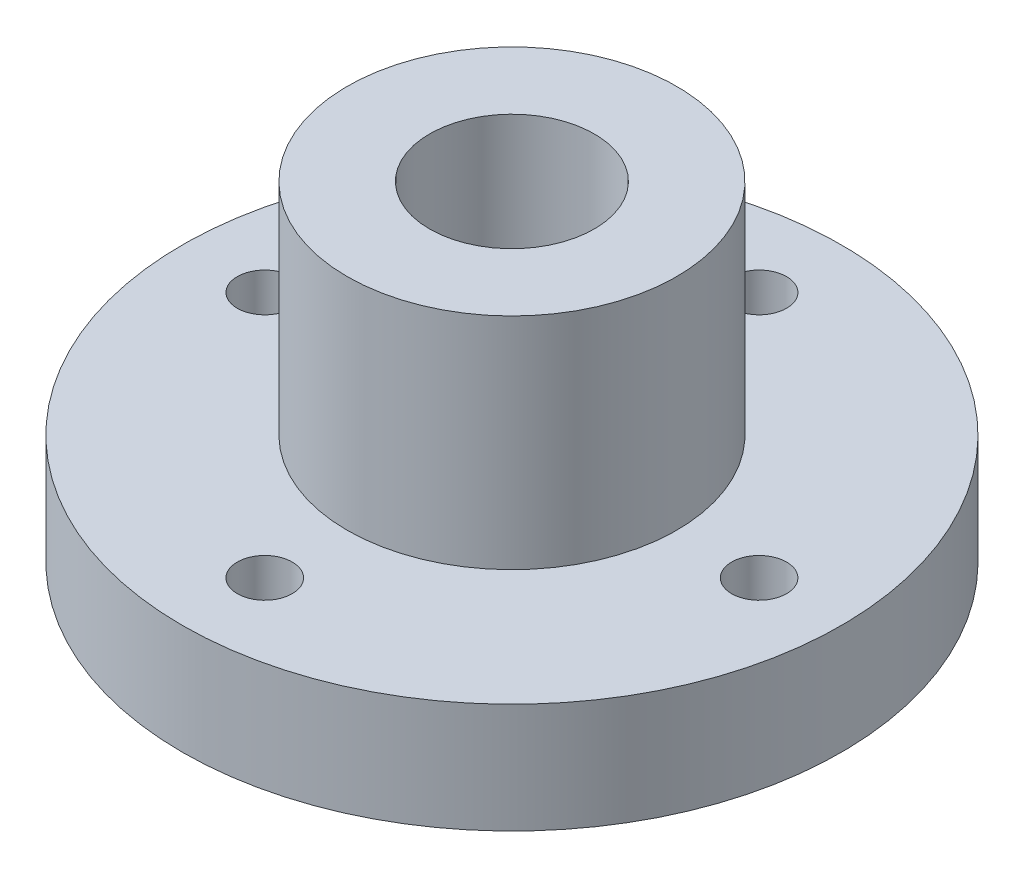
ISO-10303-21;
HEADER;
FILE_DESCRIPTION(('STEP AP214'),'2;1');
FILE_NAME('part.step','',(''),(''),'','','');
FILE_SCHEMA(('AUTOMOTIVE_DESIGN { 1 0 10303 214 1 1 1 1 }'));
ENDSEC;
DATA;
#1=APPLICATION_CONTEXT('core data for automotive mechanical design processes');
#2=APPLICATION_PROTOCOL_DEFINITION('international standard','automotive_design',2000,#1);
#3=PRODUCT_CONTEXT('',#1,'mechanical');
#4=PRODUCT('Part','Part','',(#3));
#5=PRODUCT_RELATED_PRODUCT_CATEGORY('part','',(#4));
#6=PRODUCT_DEFINITION_FORMATION('','',#4);
#7=PRODUCT_DEFINITION_CONTEXT('part definition',#1,'design');
#8=PRODUCT_DEFINITION('design','',#6,#7);
#9=PRODUCT_DEFINITION_SHAPE('','',#8);
#10=(LENGTH_UNIT() NAMED_UNIT(*) SI_UNIT(.MILLI.,.METRE.));
#11=(NAMED_UNIT(*) PLANE_ANGLE_UNIT() SI_UNIT($,.RADIAN.));
#12=(NAMED_UNIT(*) SI_UNIT($,.STERADIAN.) SOLID_ANGLE_UNIT());
#13=UNCERTAINTY_MEASURE_WITH_UNIT(LENGTH_MEASURE(1.E-05),#10,'distance_accuracy_value','');
#14=(GEOMETRIC_REPRESENTATION_CONTEXT(3) GLOBAL_UNCERTAINTY_ASSIGNED_CONTEXT((#13)) GLOBAL_UNIT_ASSIGNED_CONTEXT((#10,
#11,#12)) REPRESENTATION_CONTEXT('',''));
#15=CARTESIAN_POINT('',(0.,0.,0.));
#16=DIRECTION('',(0.,0.,1.));
#17=DIRECTION('',(1.,0.,0.));
#18=AXIS2_PLACEMENT_3D('',#15,#16,#17);
#19=CARTESIAN_POINT('',(0.,1.,-2.25));
#20=DIRECTION('',(0.,-1.,0.));
#21=DIRECTION('',(0.,0.,-1.));
#22=AXIS2_PLACEMENT_3D('',#19,#20,#21);
#23=CYLINDRICAL_SURFACE('',#22,0.25);
#24=CARTESIAN_POINT('',(0.,1.,-2.25));
#25=DIRECTION('',(0.,1.,0.));
#26=DIRECTION('',(0.,0.,1.));
#27=AXIS2_PLACEMENT_3D('',#24,#25,#26);
#28=CIRCLE('',#27,0.25);
#29=CARTESIAN_POINT('',(0.,1.,-2.));
#30=VERTEX_POINT('',#29);
#31=EDGE_CURVE('E52',#30,#30,#28,.T.);
#32=ORIENTED_EDGE('',*,*,#31,.T.);
#33=EDGE_LOOP('',(#32));
#34=FACE_BOUND('',#33,.T.);
#35=CARTESIAN_POINT('',(0.,0.,-2.25));
#36=DIRECTION('',(0.,1.,0.));
#37=DIRECTION('',(0.,0.,1.));
#38=AXIS2_PLACEMENT_3D('',#35,#36,#37);
#39=CIRCLE('',#38,0.25);
#40=CARTESIAN_POINT('',(0.,0.,-2.));
#41=VERTEX_POINT('',#40);
#42=EDGE_CURVE('E68',#41,#41,#39,.T.);
#43=ORIENTED_EDGE('',*,*,#42,.F.);
#44=EDGE_LOOP('',(#43));
#45=FACE_BOUND('',#44,.T.);
#46=ADVANCED_FACE('F37',(#34,#45),#23,.F.);
#47=CARTESIAN_POINT('',(2.25,1.,0.));
#48=DIRECTION('',(0.,-1.,0.));
#49=DIRECTION('',(0.,0.,-1.));
#50=AXIS2_PLACEMENT_3D('',#47,#48,#49);
#51=CYLINDRICAL_SURFACE('',#50,0.250000000000007);
#52=CARTESIAN_POINT('',(2.25,1.,0.));
#53=DIRECTION('',(0.,1.,0.));
#54=DIRECTION('',(0.,0.,1.));
#55=AXIS2_PLACEMENT_3D('',#52,#53,#54);
#56=CIRCLE('',#55,0.250000000000007);
#57=CARTESIAN_POINT('',(2.25,1.,0.250000000000008));
#58=VERTEX_POINT('',#57);
#59=EDGE_CURVE('E86',#58,#58,#56,.T.);
#60=ORIENTED_EDGE('',*,*,#59,.T.);
#61=EDGE_LOOP('',(#60));
#62=FACE_BOUND('',#61,.T.);
#63=CARTESIAN_POINT('',(2.25,0.,0.));
#64=DIRECTION('',(0.,1.,0.));
#65=DIRECTION('',(0.,0.,1.));
#66=AXIS2_PLACEMENT_3D('',#63,#64,#65);
#67=CIRCLE('',#66,0.250000000000007);
#68=CARTESIAN_POINT('',(2.25,0.,0.250000000000008));
#69=VERTEX_POINT('',#68);
#70=EDGE_CURVE('E65',#69,#69,#67,.T.);
#71=ORIENTED_EDGE('',*,*,#70,.F.);
#72=EDGE_LOOP('',(#71));
#73=FACE_BOUND('',#72,.T.);
#74=ADVANCED_FACE('F138',(#62,#73),#51,.F.);
#75=CARTESIAN_POINT('',(0.,1.,2.25));
#76=DIRECTION('',(0.,-1.,0.));
#77=DIRECTION('',(0.,0.,-1.));
#78=AXIS2_PLACEMENT_3D('',#75,#76,#77);
#79=CYLINDRICAL_SURFACE('',#78,0.250000000000015);
#80=CARTESIAN_POINT('',(0.,1.,2.25));
#81=DIRECTION('',(0.,1.,0.));
#82=DIRECTION('',(0.,0.,1.));
#83=AXIS2_PLACEMENT_3D('',#80,#81,#82);
#84=CIRCLE('',#83,0.250000000000015);
#85=CARTESIAN_POINT('',(0.,1.,2.50000000000002));
#86=VERTEX_POINT('',#85);
#87=EDGE_CURVE('E80',#86,#86,#84,.T.);
#88=ORIENTED_EDGE('',*,*,#87,.T.);
#89=EDGE_LOOP('',(#88));
#90=FACE_BOUND('',#89,.T.);
#91=CARTESIAN_POINT('',(0.,0.,2.25));
#92=DIRECTION('',(0.,1.,0.));
#93=DIRECTION('',(0.,0.,1.));
#94=AXIS2_PLACEMENT_3D('',#91,#92,#93);
#95=CIRCLE('',#94,0.250000000000015);
#96=CARTESIAN_POINT('',(0.,0.,2.50000000000002));
#97=VERTEX_POINT('',#96);
#98=EDGE_CURVE('E60',#97,#97,#95,.T.);
#99=ORIENTED_EDGE('',*,*,#98,.F.);
#100=EDGE_LOOP('',(#99));
#101=FACE_BOUND('',#100,.T.);
#102=ADVANCED_FACE('F143',(#90,#101),#79,.F.);
#103=CARTESIAN_POINT('',(-2.25,1.,0.));
#104=DIRECTION('',(0.,-1.,0.));
#105=DIRECTION('',(0.,0.,-1.));
#106=AXIS2_PLACEMENT_3D('',#103,#104,#105);
#107=CYLINDRICAL_SURFACE('',#106,0.250000000000022);
#108=CARTESIAN_POINT('',(-2.25,1.,0.));
#109=DIRECTION('',(0.,1.,0.));
#110=DIRECTION('',(0.,0.,1.));
#111=AXIS2_PLACEMENT_3D('',#108,#109,#110);
#112=CIRCLE('',#111,0.250000000000022);
#113=CARTESIAN_POINT('',(-2.25,1.,0.250000000000022));
#114=VERTEX_POINT('',#113);
#115=EDGE_CURVE('E75',#114,#114,#112,.T.);
#116=ORIENTED_EDGE('',*,*,#115,.T.);
#117=EDGE_LOOP('',(#116));
#118=FACE_BOUND('',#117,.T.);
#119=CARTESIAN_POINT('',(-2.25,0.,0.));
#120=DIRECTION('',(0.,1.,0.));
#121=DIRECTION('',(0.,0.,1.));
#122=AXIS2_PLACEMENT_3D('',#119,#120,#121);
#123=CIRCLE('',#122,0.250000000000022);
#124=CARTESIAN_POINT('',(-2.25,0.,0.250000000000022));
#125=VERTEX_POINT('',#124);
#126=EDGE_CURVE('E56',#125,#125,#123,.T.);
#127=ORIENTED_EDGE('',*,*,#126,.F.);
#128=EDGE_LOOP('',(#127));
#129=FACE_BOUND('',#128,.T.);
#130=ADVANCED_FACE('F39',(#118,#129),#107,.F.);
#131=CARTESIAN_POINT('',(0.,1.,0.));
#132=DIRECTION('',(0.,-1.,0.));
#133=DIRECTION('',(0.,0.,-1.));
#134=AXIS2_PLACEMENT_3D('',#131,#132,#133);
#135=CYLINDRICAL_SURFACE('',#134,3.);
#136=CARTESIAN_POINT('',(0.,1.,0.));
#137=DIRECTION('',(0.,1.,0.));
#138=DIRECTION('',(0.,0.,1.));
#139=AXIS2_PLACEMENT_3D('',#136,#137,#138);
#140=CIRCLE('',#139,3.);
#141=CARTESIAN_POINT('',(0.,1.,3.));
#142=VERTEX_POINT('',#141);
#143=EDGE_CURVE('E10',#142,#142,#140,.T.);
#144=ORIENTED_EDGE('',*,*,#143,.F.);
#145=EDGE_LOOP('',(#144));
#146=FACE_BOUND('',#145,.T.);
#147=CARTESIAN_POINT('',(0.,0.,0.));
#148=DIRECTION('',(0.,1.,0.));
#149=DIRECTION('',(0.,0.,1.));
#150=AXIS2_PLACEMENT_3D('',#147,#148,#149);
#151=CIRCLE('',#150,3.);
#152=CARTESIAN_POINT('',(0.,0.,3.));
#153=VERTEX_POINT('',#152);
#154=EDGE_CURVE('E41',#153,#153,#151,.T.);
#155=ORIENTED_EDGE('',*,*,#154,.T.);
#156=EDGE_LOOP('',(#155));
#157=FACE_BOUND('',#156,.T.);
#158=ADVANCED_FACE('F104',(#146,#157),#135,.T.);
#159=CARTESIAN_POINT('',(0.,1.,0.));
#160=DIRECTION('',(0.,1.,0.));
#161=DIRECTION('',(0.,0.,1.));
#162=AXIS2_PLACEMENT_3D('',#159,#160,#161);
#163=PLANE('',#162);
#164=ORIENTED_EDGE('',*,*,#115,.F.);
#165=EDGE_LOOP('',(#164));
#166=FACE_BOUND('',#165,.T.);
#167=ORIENTED_EDGE('',*,*,#87,.F.);
#168=EDGE_LOOP('',(#167));
#169=FACE_BOUND('',#168,.T.);
#170=ORIENTED_EDGE('',*,*,#59,.F.);
#171=EDGE_LOOP('',(#170));
#172=FACE_BOUND('',#171,.T.);
#173=ORIENTED_EDGE('',*,*,#31,.F.);
#174=EDGE_LOOP('',(#173));
#175=FACE_BOUND('',#174,.T.);
#176=CARTESIAN_POINT('',(0.,1.,0.));
#177=DIRECTION('',(0.,1.,0.));
#178=DIRECTION('',(0.,0.,1.));
#179=AXIS2_PLACEMENT_3D('',#176,#177,#178);
#180=CIRCLE('',#179,1.5);
#181=CARTESIAN_POINT('',(0.,1.,1.5));
#182=VERTEX_POINT('',#181);
#183=EDGE_CURVE('E46',#182,#182,#180,.T.);
#184=ORIENTED_EDGE('',*,*,#183,.F.);
#185=EDGE_LOOP('',(#184));
#186=FACE_BOUND('',#185,.T.);
#187=ORIENTED_EDGE('',*,*,#143,.T.);
#188=EDGE_LOOP('',(#187));
#189=FACE_BOUND('',#188,.T.);
#190=ADVANCED_FACE('F100',(#166,#169,#172,#175,#186,#189),#163,.T.);
#191=CARTESIAN_POINT('',(0.,0.,0.));
#192=DIRECTION('',(0.,1.,0.));
#193=DIRECTION('',(0.,0.,1.));
#194=AXIS2_PLACEMENT_3D('',#191,#192,#193);
#195=PLANE('',#194);
#196=ORIENTED_EDGE('',*,*,#126,.T.);
#197=EDGE_LOOP('',(#196));
#198=FACE_BOUND('',#197,.T.);
#199=ORIENTED_EDGE('',*,*,#98,.T.);
#200=EDGE_LOOP('',(#199));
#201=FACE_BOUND('',#200,.T.);
#202=ORIENTED_EDGE('',*,*,#70,.T.);
#203=EDGE_LOOP('',(#202));
#204=FACE_BOUND('',#203,.T.);
#205=ORIENTED_EDGE('',*,*,#42,.T.);
#206=EDGE_LOOP('',(#205));
#207=FACE_BOUND('',#206,.T.);
#208=ORIENTED_EDGE('',*,*,#154,.F.);
#209=EDGE_LOOP('',(#208));
#210=FACE_BOUND('',#209,.T.);
#211=CARTESIAN_POINT('',(0.,0.,0.));
#212=DIRECTION('',(0.,1.,0.));
#213=DIRECTION('',(0.,0.,1.));
#214=AXIS2_PLACEMENT_3D('',#211,#212,#213);
#215=CIRCLE('',#214,0.75);
#216=CARTESIAN_POINT('',(0.,0.,0.75));
#217=VERTEX_POINT('',#216);
#218=EDGE_CURVE('E89',#217,#217,#215,.T.);
#219=ORIENTED_EDGE('',*,*,#218,.T.);
#220=EDGE_LOOP('',(#219));
#221=FACE_BOUND('',#220,.T.);
#222=ADVANCED_FACE('F103',(#198,#201,#204,#207,#210,#221),#195,.F.);
#223=CARTESIAN_POINT('',(0.,3.,0.));
#224=DIRECTION('',(0.,-1.,0.));
#225=DIRECTION('',(0.,0.,-1.));
#226=AXIS2_PLACEMENT_3D('',#223,#224,#225);
#227=CYLINDRICAL_SURFACE('',#226,0.75);
#228=CARTESIAN_POINT('',(0.,3.,0.));
#229=DIRECTION('',(0.,1.,0.));
#230=DIRECTION('',(0.,0.,1.));
#231=AXIS2_PLACEMENT_3D('',#228,#229,#230);
#232=CIRCLE('',#231,0.75);
#233=CARTESIAN_POINT('',(0.,3.,0.75));
#234=VERTEX_POINT('',#233);
#235=EDGE_CURVE('E119',#234,#234,#232,.T.);
#236=ORIENTED_EDGE('',*,*,#235,.T.);
#237=EDGE_LOOP('',(#236));
#238=FACE_BOUND('',#237,.T.);
#239=ORIENTED_EDGE('',*,*,#218,.F.);
#240=EDGE_LOOP('',(#239));
#241=FACE_BOUND('',#240,.T.);
#242=ADVANCED_FACE('F113',(#238,#241),#227,.F.);
#243=CARTESIAN_POINT('',(0.,3.,0.));
#244=DIRECTION('',(0.,-1.,0.));
#245=DIRECTION('',(0.,0.,-1.));
#246=AXIS2_PLACEMENT_3D('',#243,#244,#245);
#247=CYLINDRICAL_SURFACE('',#246,1.5);
#248=ORIENTED_EDGE('',*,*,#183,.T.);
#249=EDGE_LOOP('',(#248));
#250=FACE_BOUND('',#249,.T.);
#251=CARTESIAN_POINT('',(0.,3.,0.));
#252=DIRECTION('',(0.,1.,0.));
#253=DIRECTION('',(0.,0.,1.));
#254=AXIS2_PLACEMENT_3D('',#251,#252,#253);
#255=CIRCLE('',#254,1.5);
#256=CARTESIAN_POINT('',(0.,3.,1.5));
#257=VERTEX_POINT('',#256);
#258=EDGE_CURVE('E61',#257,#257,#255,.T.);
#259=ORIENTED_EDGE('',*,*,#258,.F.);
#260=EDGE_LOOP('',(#259));
#261=FACE_BOUND('',#260,.T.);
#262=ADVANCED_FACE('F109',(#250,#261),#247,.T.);
#263=CARTESIAN_POINT('',(0.,3.,0.));
#264=DIRECTION('',(0.,1.,0.));
#265=DIRECTION('',(0.,0.,1.));
#266=AXIS2_PLACEMENT_3D('',#263,#264,#265);
#267=PLANE('',#266);
#268=ORIENTED_EDGE('',*,*,#235,.F.);
#269=EDGE_LOOP('',(#268));
#270=FACE_BOUND('',#269,.T.);
#271=ORIENTED_EDGE('',*,*,#258,.T.);
#272=EDGE_LOOP('',(#271));
#273=FACE_BOUND('',#272,.T.);
#274=ADVANCED_FACE('F112',(#270,#273),#267,.T.);
#275=CLOSED_SHELL('',(#46,#74,#102,#130,#158,#190,#222,#242,#262,#274));
#276=MANIFOLD_SOLID_BREP('B2',#275);
#277=ADVANCED_BREP_SHAPE_REPRESENTATION('',(#18,#276),#14);
#278=SHAPE_DEFINITION_REPRESENTATION(#9,#277);
ENDSEC;
END-ISO-10303-21;
